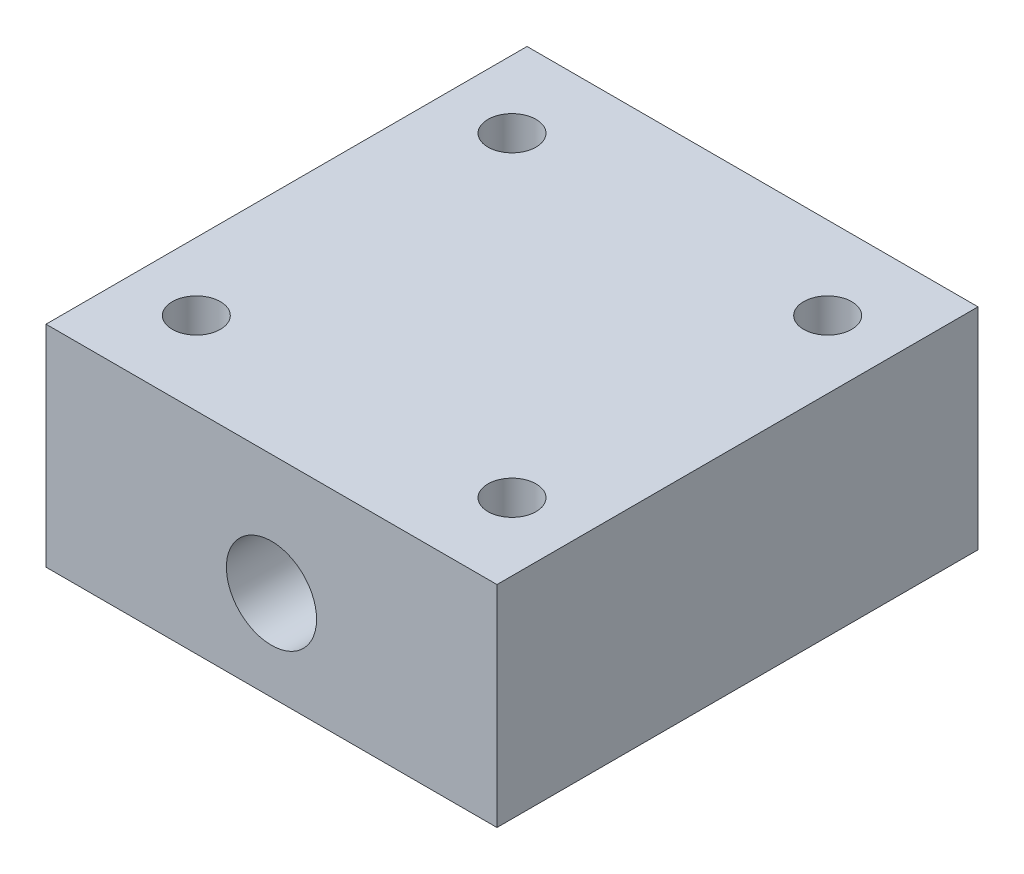
ISO-10303-21;
HEADER;
FILE_DESCRIPTION(('STEP AP214'),'2;1');
FILE_NAME('part.step','',(''),(''),'','','');
FILE_SCHEMA(('AUTOMOTIVE_DESIGN { 1 0 10303 214 1 1 1 1 }'));
ENDSEC;
DATA;
#1=APPLICATION_CONTEXT('core data for automotive mechanical design processes');
#2=APPLICATION_PROTOCOL_DEFINITION('international standard','automotive_design',2000,#1);
#3=PRODUCT_CONTEXT('',#1,'mechanical');
#4=PRODUCT('Part','Part','',(#3));
#5=PRODUCT_RELATED_PRODUCT_CATEGORY('part','',(#4));
#6=PRODUCT_DEFINITION_FORMATION('','',#4);
#7=PRODUCT_DEFINITION_CONTEXT('part definition',#1,'design');
#8=PRODUCT_DEFINITION('design','',#6,#7);
#9=PRODUCT_DEFINITION_SHAPE('','',#8);
#10=(LENGTH_UNIT() NAMED_UNIT(*) SI_UNIT(.MILLI.,.METRE.));
#11=(NAMED_UNIT(*) PLANE_ANGLE_UNIT() SI_UNIT($,.RADIAN.));
#12=(NAMED_UNIT(*) SI_UNIT($,.STERADIAN.) SOLID_ANGLE_UNIT());
#13=UNCERTAINTY_MEASURE_WITH_UNIT(LENGTH_MEASURE(1.E-05),#10,'distance_accuracy_value','');
#14=(GEOMETRIC_REPRESENTATION_CONTEXT(3) GLOBAL_UNCERTAINTY_ASSIGNED_CONTEXT((#13)) GLOBAL_UNIT_ASSIGNED_CONTEXT((#10,
#11,#12)) REPRESENTATION_CONTEXT('',''));
#15=CARTESIAN_POINT('',(0.,0.,0.));
#16=DIRECTION('',(0.,0.,1.));
#17=DIRECTION('',(1.,0.,0.));
#18=AXIS2_PLACEMENT_3D('',#15,#16,#17);
#19=CARTESIAN_POINT('',(-15.,-6.,44.2843781207323));
#20=DIRECTION('',(-1.,0.,0.));
#21=DIRECTION('',(0.,0.,1.));
#22=AXIS2_PLACEMENT_3D('',#19,#20,#21);
#23=PLANE('',#22);
#24=DIRECTION('',(0.,0.,1.));
#25=VECTOR('',#24,1.);
#26=CARTESIAN_POINT('',(-15.,8.,44.2843781207323));
#27=LINE('',#26,#25);
#28=CARTESIAN_POINT('',(-15.,8.,44.2843781207323));
#29=VERTEX_POINT('',#28);
#30=CARTESIAN_POINT('',(-15.,8.,76.2843781207323));
#31=VERTEX_POINT('',#30);
#32=EDGE_CURVE('E128',#29,#31,#27,.T.);
#33=ORIENTED_EDGE('',*,*,#32,.F.);
#34=DIRECTION('',(0.,1.,0.));
#35=VECTOR('',#34,1.);
#36=CARTESIAN_POINT('',(-15.,-6.,44.2843781207323));
#37=LINE('',#36,#35);
#38=CARTESIAN_POINT('',(-15.,-6.,44.2843781207323));
#39=VERTEX_POINT('',#38);
#40=EDGE_CURVE('E11',#39,#29,#37,.T.);
#41=ORIENTED_EDGE('',*,*,#40,.F.);
#42=DIRECTION('',(0.,0.,1.));
#43=VECTOR('',#42,1.);
#44=CARTESIAN_POINT('',(-15.,-6.,44.2843781207323));
#45=LINE('',#44,#43);
#46=CARTESIAN_POINT('',(-15.,-6.,76.2843781207323));
#47=VERTEX_POINT('',#46);
#48=EDGE_CURVE('E129',#39,#47,#45,.T.);
#49=ORIENTED_EDGE('',*,*,#48,.T.);
#50=DIRECTION('',(0.,1.,0.));
#51=VECTOR('',#50,1.);
#52=CARTESIAN_POINT('',(-15.,-6.,76.2843781207323));
#53=LINE('',#52,#51);
#54=EDGE_CURVE('E77',#47,#31,#53,.T.);
#55=ORIENTED_EDGE('',*,*,#54,.T.);
#56=EDGE_LOOP('',(#33,#41,#49,#55));
#57=FACE_BOUND('',#56,.T.);
#58=ADVANCED_FACE('F33',(#57),#23,.T.);
#59=CARTESIAN_POINT('',(-15.,-6.,44.2843781207323));
#60=DIRECTION('',(0.,0.,-1.));
#61=DIRECTION('',(-1.,0.,0.));
#62=AXIS2_PLACEMENT_3D('',#59,#60,#61);
#63=PLANE('',#62);
#64=CARTESIAN_POINT('',(0.,0.,44.2843781207323));
#65=DIRECTION('',(0.,0.,-1.));
#66=DIRECTION('',(-1.,0.,0.));
#67=AXIS2_PLACEMENT_3D('',#64,#65,#66);
#68=CIRCLE('',#67,3.);
#69=CARTESIAN_POINT('',(-3.,0.,44.2843781207323));
#70=VERTEX_POINT('',#69);
#71=EDGE_CURVE('E125',#70,#70,#68,.T.);
#72=ORIENTED_EDGE('',*,*,#71,.F.);
#73=EDGE_LOOP('',(#72));
#74=FACE_BOUND('',#73,.T.);
#75=DIRECTION('',(-1.,0.,0.));
#76=VECTOR('',#75,1.);
#77=CARTESIAN_POINT('',(-15.,8.,44.2843781207323));
#78=LINE('',#77,#76);
#79=CARTESIAN_POINT('',(15.,8.,44.2843781207323));
#80=VERTEX_POINT('',#79);
#81=EDGE_CURVE('E132',#80,#29,#78,.T.);
#82=ORIENTED_EDGE('',*,*,#81,.F.);
#83=DIRECTION('',(0.,1.,0.));
#84=VECTOR('',#83,1.);
#85=CARTESIAN_POINT('',(15.,-6.,44.2843781207323));
#86=LINE('',#85,#84);
#87=CARTESIAN_POINT('',(15.,-6.,44.2843781207323));
#88=VERTEX_POINT('',#87);
#89=EDGE_CURVE('E42',#88,#80,#86,.T.);
#90=ORIENTED_EDGE('',*,*,#89,.F.);
#91=DIRECTION('',(-1.,0.,0.));
#92=VECTOR('',#91,1.);
#93=CARTESIAN_POINT('',(-15.,-6.,44.2843781207323));
#94=LINE('',#93,#92);
#95=EDGE_CURVE('E136',#88,#39,#94,.T.);
#96=ORIENTED_EDGE('',*,*,#95,.T.);
#97=ORIENTED_EDGE('',*,*,#40,.T.);
#98=EDGE_LOOP('',(#82,#90,#96,#97));
#99=FACE_BOUND('',#98,.T.);
#100=ADVANCED_FACE('F152',(#74,#99),#63,.T.);
#101=CARTESIAN_POINT('',(15.,-6.,44.2843781207323));
#102=DIRECTION('',(1.,0.,0.));
#103=DIRECTION('',(0.,0.,-1.));
#104=AXIS2_PLACEMENT_3D('',#101,#102,#103);
#105=PLANE('',#104);
#106=DIRECTION('',(0.,0.,-1.));
#107=VECTOR('',#106,1.);
#108=CARTESIAN_POINT('',(15.,8.,44.2843781207323));
#109=LINE('',#108,#107);
#110=CARTESIAN_POINT('',(15.,8.,76.2843781207323));
#111=VERTEX_POINT('',#110);
#112=EDGE_CURVE('E143',#111,#80,#109,.T.);
#113=ORIENTED_EDGE('',*,*,#112,.F.);
#114=DIRECTION('',(0.,1.,0.));
#115=VECTOR('',#114,1.);
#116=CARTESIAN_POINT('',(15.,-6.,76.2843781207323));
#117=LINE('',#116,#115);
#118=CARTESIAN_POINT('',(15.,-6.,76.2843781207323));
#119=VERTEX_POINT('',#118);
#120=EDGE_CURVE('E148',#119,#111,#117,.T.);
#121=ORIENTED_EDGE('',*,*,#120,.F.);
#122=DIRECTION('',(0.,0.,-1.));
#123=VECTOR('',#122,1.);
#124=CARTESIAN_POINT('',(15.,-6.,44.2843781207323));
#125=LINE('',#124,#123);
#126=EDGE_CURVE('E134',#119,#88,#125,.T.);
#127=ORIENTED_EDGE('',*,*,#126,.T.);
#128=ORIENTED_EDGE('',*,*,#89,.T.);
#129=EDGE_LOOP('',(#113,#121,#127,#128));
#130=FACE_BOUND('',#129,.T.);
#131=ADVANCED_FACE('F155',(#130),#105,.T.);
#132=CARTESIAN_POINT('',(-15.,-6.,76.2843781207323));
#133=DIRECTION('',(0.,0.,1.));
#134=DIRECTION('',(1.,0.,0.));
#135=AXIS2_PLACEMENT_3D('',#132,#133,#134);
#136=PLANE('',#135);
#137=CARTESIAN_POINT('',(0.,0.,76.2843781207323));
#138=DIRECTION('',(0.,0.,1.));
#139=DIRECTION('',(1.,0.,0.));
#140=AXIS2_PLACEMENT_3D('',#137,#138,#139);
#141=CIRCLE('',#140,3.);
#142=CARTESIAN_POINT('',(3.,0.,76.2843781207323));
#143=VERTEX_POINT('',#142);
#144=EDGE_CURVE('E36',#143,#143,#141,.T.);
#145=ORIENTED_EDGE('',*,*,#144,.F.);
#146=EDGE_LOOP('',(#145));
#147=FACE_BOUND('',#146,.T.);
#148=DIRECTION('',(1.,0.,0.));
#149=VECTOR('',#148,1.);
#150=CARTESIAN_POINT('',(-15.,8.,76.2843781207323));
#151=LINE('',#150,#149);
#152=EDGE_CURVE('E140',#31,#111,#151,.T.);
#153=ORIENTED_EDGE('',*,*,#152,.F.);
#154=ORIENTED_EDGE('',*,*,#54,.F.);
#155=DIRECTION('',(1.,0.,0.));
#156=VECTOR('',#155,1.);
#157=CARTESIAN_POINT('',(-15.,-6.,76.2843781207323));
#158=LINE('',#157,#156);
#159=EDGE_CURVE('E131',#47,#119,#158,.T.);
#160=ORIENTED_EDGE('',*,*,#159,.T.);
#161=ORIENTED_EDGE('',*,*,#120,.T.);
#162=EDGE_LOOP('',(#153,#154,#160,#161));
#163=FACE_BOUND('',#162,.T.);
#164=ADVANCED_FACE('F149',(#147,#163),#136,.T.);
#165=CARTESIAN_POINT('',(0.,-6.,0.));
#166=DIRECTION('',(0.,1.,0.));
#167=DIRECTION('',(0.,0.,1.));
#168=AXIS2_PLACEMENT_3D('',#165,#166,#167);
#169=PLANE('',#168);
#170=ORIENTED_EDGE('',*,*,#48,.F.);
#171=ORIENTED_EDGE('',*,*,#95,.F.);
#172=ORIENTED_EDGE('',*,*,#126,.F.);
#173=ORIENTED_EDGE('',*,*,#159,.F.);
#174=EDGE_LOOP('',(#170,#171,#172,#173));
#175=FACE_BOUND('',#174,.T.);
#176=ADVANCED_FACE('F157',(#175),#169,.F.);
#177=CARTESIAN_POINT('',(0.,8.,0.));
#178=DIRECTION('',(0.,1.,0.));
#179=DIRECTION('',(0.,0.,1.));
#180=AXIS2_PLACEMENT_3D('',#177,#178,#179);
#181=PLANE('',#180);
#182=CARTESIAN_POINT('',(10.5,8.,49.7843781207323));
#183=DIRECTION('',(0.,1.,0.));
#184=DIRECTION('',(0.,0.,1.));
#185=AXIS2_PLACEMENT_3D('',#182,#183,#184);
#186=CIRCLE('',#185,1.59999999999999);
#187=CARTESIAN_POINT('',(10.5,8.,51.3843781207323));
#188=VERTEX_POINT('',#187);
#189=EDGE_CURVE('E103',#188,#188,#186,.T.);
#190=ORIENTED_EDGE('',*,*,#189,.F.);
#191=EDGE_LOOP('',(#190));
#192=FACE_BOUND('',#191,.T.);
#193=CARTESIAN_POINT('',(-10.5,8.,49.7843781207323));
#194=DIRECTION('',(0.,1.,0.));
#195=DIRECTION('',(0.,0.,1.));
#196=AXIS2_PLACEMENT_3D('',#193,#194,#195);
#197=CIRCLE('',#196,1.59999999999999);
#198=CARTESIAN_POINT('',(-10.5,8.,51.3843781207323));
#199=VERTEX_POINT('',#198);
#200=EDGE_CURVE('E102',#199,#199,#197,.T.);
#201=ORIENTED_EDGE('',*,*,#200,.F.);
#202=EDGE_LOOP('',(#201));
#203=FACE_BOUND('',#202,.T.);
#204=CARTESIAN_POINT('',(-10.5,8.,70.7843781207323));
#205=DIRECTION('',(0.,1.,0.));
#206=DIRECTION('',(0.,0.,1.));
#207=AXIS2_PLACEMENT_3D('',#204,#205,#206);
#208=CIRCLE('',#207,1.59999999999999);
#209=CARTESIAN_POINT('',(-10.5,8.,72.3843781207323));
#210=VERTEX_POINT('',#209);
#211=EDGE_CURVE('E113',#210,#210,#208,.T.);
#212=ORIENTED_EDGE('',*,*,#211,.F.);
#213=EDGE_LOOP('',(#212));
#214=FACE_BOUND('',#213,.T.);
#215=CARTESIAN_POINT('',(10.5,8.,70.7843781207323));
#216=DIRECTION('',(0.,1.,0.));
#217=DIRECTION('',(0.,0.,1.));
#218=AXIS2_PLACEMENT_3D('',#215,#216,#217);
#219=CIRCLE('',#218,1.59999999999999);
#220=CARTESIAN_POINT('',(10.5,8.,72.3843781207323));
#221=VERTEX_POINT('',#220);
#222=EDGE_CURVE('E119',#221,#221,#219,.T.);
#223=ORIENTED_EDGE('',*,*,#222,.F.);
#224=EDGE_LOOP('',(#223));
#225=FACE_BOUND('',#224,.T.);
#226=ORIENTED_EDGE('',*,*,#32,.T.);
#227=ORIENTED_EDGE('',*,*,#152,.T.);
#228=ORIENTED_EDGE('',*,*,#112,.T.);
#229=ORIENTED_EDGE('',*,*,#81,.T.);
#230=EDGE_LOOP('',(#226,#227,#228,#229));
#231=FACE_BOUND('',#230,.T.);
#232=ADVANCED_FACE('F151',(#192,#203,#214,#225,#231),#181,.T.);
#233=CARTESIAN_POINT('',(0.,0.,0.869578928107368));
#234=DIRECTION('',(0.,0.,1.));
#235=DIRECTION('',(1.,0.,0.));
#236=AXIS2_PLACEMENT_3D('',#233,#234,#235);
#237=CYLINDRICAL_SURFACE('',#236,3.);
#238=ORIENTED_EDGE('',*,*,#71,.T.);
#239=EDGE_LOOP('',(#238));
#240=FACE_BOUND('',#239,.T.);
#241=ORIENTED_EDGE('',*,*,#144,.T.);
#242=EDGE_LOOP('',(#241));
#243=FACE_BOUND('',#242,.T.);
#244=ADVANCED_FACE('F164',(#240,#243),#237,.F.);
#245=CARTESIAN_POINT('',(10.5,0.999999999999997,70.7843781207323));
#246=DIRECTION('',(0.,1.,0.));
#247=DIRECTION('',(0.,0.,1.));
#248=AXIS2_PLACEMENT_3D('',#245,#246,#247);
#249=CONICAL_SURFACE('',#248,1.6,1.02974425867665);
#250=CARTESIAN_POINT('',(10.5,0.0386230095558993,70.7843781207323));
#251=VERTEX_POINT('',#250);
#252=VERTEX_LOOP('',#251);
#253=FACE_BOUND('',#252,.T.);
#254=CARTESIAN_POINT('',(10.5,0.999999999999997,70.7843781207323));
#255=DIRECTION('',(0.,1.,0.));
#256=DIRECTION('',(0.,0.,1.));
#257=AXIS2_PLACEMENT_3D('',#254,#255,#256);
#258=CIRCLE('',#257,1.6);
#259=CARTESIAN_POINT('',(10.5,0.999999999999997,72.3843781207323));
#260=VERTEX_POINT('',#259);
#261=EDGE_CURVE('E122',#260,#260,#258,.T.);
#262=ORIENTED_EDGE('',*,*,#261,.T.);
#263=EDGE_LOOP('',(#262));
#264=FACE_BOUND('',#263,.T.);
#265=ADVANCED_FACE('F183',(#253,#264),#249,.F.);
#266=CARTESIAN_POINT('',(10.5,8.,70.7843781207323));
#267=DIRECTION('',(0.,1.,0.));
#268=DIRECTION('',(0.,0.,1.));
#269=AXIS2_PLACEMENT_3D('',#266,#267,#268);
#270=CYLINDRICAL_SURFACE('',#269,1.59999999999999);
#271=ORIENTED_EDGE('',*,*,#261,.F.);
#272=EDGE_LOOP('',(#271));
#273=FACE_BOUND('',#272,.T.);
#274=ORIENTED_EDGE('',*,*,#222,.T.);
#275=EDGE_LOOP('',(#274));
#276=FACE_BOUND('',#275,.T.);
#277=ADVANCED_FACE('F189',(#273,#276),#270,.F.);
#278=CARTESIAN_POINT('',(-10.5,0.999999999999997,70.7843781207323));
#279=DIRECTION('',(0.,1.,0.));
#280=DIRECTION('',(0.,0.,1.));
#281=AXIS2_PLACEMENT_3D('',#278,#279,#280);
#282=CONICAL_SURFACE('',#281,1.6,1.02974425867665);
#283=CARTESIAN_POINT('',(-10.5,0.0386230095558993,70.7843781207323));
#284=VERTEX_POINT('',#283);
#285=VERTEX_LOOP('',#284);
#286=FACE_BOUND('',#285,.T.);
#287=CARTESIAN_POINT('',(-10.5,0.999999999999997,70.7843781207323));
#288=DIRECTION('',(0.,1.,0.));
#289=DIRECTION('',(0.,0.,1.));
#290=AXIS2_PLACEMENT_3D('',#287,#288,#289);
#291=CIRCLE('',#290,1.6);
#292=CARTESIAN_POINT('',(-10.5,0.999999999999997,72.3843781207323));
#293=VERTEX_POINT('',#292);
#294=EDGE_CURVE('E116',#293,#293,#291,.T.);
#295=ORIENTED_EDGE('',*,*,#294,.T.);
#296=EDGE_LOOP('',(#295));
#297=FACE_BOUND('',#296,.T.);
#298=ADVANCED_FACE('F195',(#286,#297),#282,.F.);
#299=CARTESIAN_POINT('',(-10.5,8.,70.7843781207323));
#300=DIRECTION('',(0.,1.,0.));
#301=DIRECTION('',(0.,0.,1.));
#302=AXIS2_PLACEMENT_3D('',#299,#300,#301);
#303=CYLINDRICAL_SURFACE('',#302,1.59999999999999);
#304=ORIENTED_EDGE('',*,*,#294,.F.);
#305=EDGE_LOOP('',(#304));
#306=FACE_BOUND('',#305,.T.);
#307=ORIENTED_EDGE('',*,*,#211,.T.);
#308=EDGE_LOOP('',(#307));
#309=FACE_BOUND('',#308,.T.);
#310=ADVANCED_FACE('F199',(#306,#309),#303,.F.);
#311=CARTESIAN_POINT('',(-10.5,0.999999999999997,49.7843781207323));
#312=DIRECTION('',(0.,1.,0.));
#313=DIRECTION('',(0.,0.,1.));
#314=AXIS2_PLACEMENT_3D('',#311,#312,#313);
#315=CONICAL_SURFACE('',#314,1.6,1.02974425867665);
#316=CARTESIAN_POINT('',(-10.5,0.0386230095558993,49.7843781207323));
#317=VERTEX_POINT('',#316);
#318=VERTEX_LOOP('',#317);
#319=FACE_BOUND('',#318,.T.);
#320=CARTESIAN_POINT('',(-10.5,0.999999999999997,49.7843781207323));
#321=DIRECTION('',(0.,1.,0.));
#322=DIRECTION('',(0.,0.,1.));
#323=AXIS2_PLACEMENT_3D('',#320,#321,#322);
#324=CIRCLE('',#323,1.6);
#325=CARTESIAN_POINT('',(-10.5,0.999999999999997,51.3843781207323));
#326=VERTEX_POINT('',#325);
#327=EDGE_CURVE('E106',#326,#326,#324,.T.);
#328=ORIENTED_EDGE('',*,*,#327,.T.);
#329=EDGE_LOOP('',(#328));
#330=FACE_BOUND('',#329,.T.);
#331=ADVANCED_FACE('F203',(#319,#330),#315,.F.);
#332=CARTESIAN_POINT('',(-10.5,8.,49.7843781207323));
#333=DIRECTION('',(0.,1.,0.));
#334=DIRECTION('',(0.,0.,1.));
#335=AXIS2_PLACEMENT_3D('',#332,#333,#334);
#336=CYLINDRICAL_SURFACE('',#335,1.59999999999999);
#337=ORIENTED_EDGE('',*,*,#327,.F.);
#338=EDGE_LOOP('',(#337));
#339=FACE_BOUND('',#338,.T.);
#340=ORIENTED_EDGE('',*,*,#200,.T.);
#341=EDGE_LOOP('',(#340));
#342=FACE_BOUND('',#341,.T.);
#343=ADVANCED_FACE('F96',(#339,#342),#336,.F.);
#344=CARTESIAN_POINT('',(10.5,0.999999999999997,49.7843781207323));
#345=DIRECTION('',(0.,1.,0.));
#346=DIRECTION('',(0.,0.,1.));
#347=AXIS2_PLACEMENT_3D('',#344,#345,#346);
#348=CONICAL_SURFACE('',#347,1.6,1.02974425867665);
#349=CARTESIAN_POINT('',(10.5,0.0386230095558993,49.7843781207323));
#350=VERTEX_POINT('',#349);
#351=VERTEX_LOOP('',#350);
#352=FACE_BOUND('',#351,.T.);
#353=CARTESIAN_POINT('',(10.5,0.999999999999997,49.7843781207323));
#354=DIRECTION('',(0.,1.,0.));
#355=DIRECTION('',(0.,0.,1.));
#356=AXIS2_PLACEMENT_3D('',#353,#354,#355);
#357=CIRCLE('',#356,1.6);
#358=CARTESIAN_POINT('',(10.5,0.999999999999997,51.3843781207323));
#359=VERTEX_POINT('',#358);
#360=EDGE_CURVE('E100',#359,#359,#357,.T.);
#361=ORIENTED_EDGE('',*,*,#360,.T.);
#362=EDGE_LOOP('',(#361));
#363=FACE_BOUND('',#362,.T.);
#364=ADVANCED_FACE('F92',(#352,#363),#348,.F.);
#365=CARTESIAN_POINT('',(10.5,8.,49.7843781207323));
#366=DIRECTION('',(0.,1.,0.));
#367=DIRECTION('',(0.,0.,1.));
#368=AXIS2_PLACEMENT_3D('',#365,#366,#367);
#369=CYLINDRICAL_SURFACE('',#368,1.59999999999999);
#370=ORIENTED_EDGE('',*,*,#360,.F.);
#371=EDGE_LOOP('',(#370));
#372=FACE_BOUND('',#371,.T.);
#373=ORIENTED_EDGE('',*,*,#189,.T.);
#374=EDGE_LOOP('',(#373));
#375=FACE_BOUND('',#374,.T.);
#376=ADVANCED_FACE('F95',(#372,#375),#369,.F.);
#377=CLOSED_SHELL('',(#58,#100,#131,#164,#176,#232,#244,#265,#277,#298,#310,#331,#343,#364,#376));
#378=MANIFOLD_SOLID_BREP('B2',#377);
#379=ADVANCED_BREP_SHAPE_REPRESENTATION('',(#18,#378),#14);
#380=SHAPE_DEFINITION_REPRESENTATION(#9,#379);
ENDSEC;
END-ISO-10303-21;
